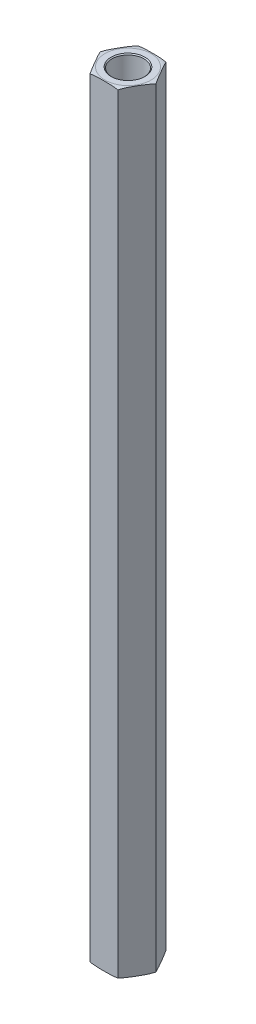
ISO-10303-21;
HEADER;
FILE_DESCRIPTION(('STEP AP214'),'2;1');
FILE_NAME('part.step','',(''),(''),'','','');
FILE_SCHEMA(('AUTOMOTIVE_DESIGN { 1 0 10303 214 1 1 1 1 }'));
ENDSEC;
DATA;
#1=APPLICATION_CONTEXT('core data for automotive mechanical design processes');
#2=APPLICATION_PROTOCOL_DEFINITION('international standard','automotive_design',2000,#1);
#3=PRODUCT_CONTEXT('',#1,'mechanical');
#4=PRODUCT('Part','Part','',(#3));
#5=PRODUCT_RELATED_PRODUCT_CATEGORY('part','',(#4));
#6=PRODUCT_DEFINITION_FORMATION('','',#4);
#7=PRODUCT_DEFINITION_CONTEXT('part definition',#1,'design');
#8=PRODUCT_DEFINITION('design','',#6,#7);
#9=PRODUCT_DEFINITION_SHAPE('','',#8);
#10=(LENGTH_UNIT() NAMED_UNIT(*) SI_UNIT(.MILLI.,.METRE.));
#11=(NAMED_UNIT(*) PLANE_ANGLE_UNIT() SI_UNIT($,.RADIAN.));
#12=(NAMED_UNIT(*) SI_UNIT($,.STERADIAN.) SOLID_ANGLE_UNIT());
#13=UNCERTAINTY_MEASURE_WITH_UNIT(LENGTH_MEASURE(1.E-05),#10,'distance_accuracy_value','');
#14=(GEOMETRIC_REPRESENTATION_CONTEXT(3) GLOBAL_UNCERTAINTY_ASSIGNED_CONTEXT((#13)) GLOBAL_UNIT_ASSIGNED_CONTEXT((#10,
#11,#12)) REPRESENTATION_CONTEXT('',''));
#15=CARTESIAN_POINT('',(0.,0.,0.));
#16=DIRECTION('',(0.,0.,1.));
#17=DIRECTION('',(1.,0.,0.));
#18=AXIS2_PLACEMENT_3D('',#15,#16,#17);
#19=CARTESIAN_POINT('',(0.,38.1,0.));
#20=DIRECTION('',(0.,1.,0.));
#21=DIRECTION('',(0.,0.,1.));
#22=AXIS2_PLACEMENT_3D('',#19,#20,#21);
#23=PLANE('',#22);
#24=CARTESIAN_POINT('',(0.,38.1,0.));
#25=DIRECTION('',(0.,1.,0.));
#26=DIRECTION('',(0.,0.,1.));
#27=AXIS2_PLACEMENT_3D('',#24,#25,#26);
#28=CIRCLE('',#27,2.0955);
#29=CARTESIAN_POINT('',(0.,38.1,2.0955));
#30=VERTEX_POINT('',#29);
#31=EDGE_CURVE('E400',#30,#30,#28,.T.);
#32=ORIENTED_EDGE('',*,*,#31,.T.);
#33=EDGE_LOOP('',(#32));
#34=FACE_BOUND('',#33,.T.);
#35=ADVANCED_FACE('F16',(#34),#23,.T.);
#36=CARTESIAN_POINT('',(0.,-38.1,0.));
#37=DIRECTION('',(0.,-1.,0.));
#38=DIRECTION('',(0.,0.,-1.));
#39=AXIS2_PLACEMENT_3D('',#36,#37,#38);
#40=PLANE('',#39);
#41=CARTESIAN_POINT('',(0.,-38.1,0.));
#42=DIRECTION('',(0.,-1.,0.));
#43=DIRECTION('',(0.,0.,-1.));
#44=AXIS2_PLACEMENT_3D('',#41,#42,#43);
#45=CIRCLE('',#44,2.0955);
#46=CARTESIAN_POINT('',(0.,-38.1,-2.0955));
#47=VERTEX_POINT('',#46);
#48=EDGE_CURVE('E129',#47,#47,#45,.T.);
#49=ORIENTED_EDGE('',*,*,#48,.T.);
#50=EDGE_LOOP('',(#49));
#51=FACE_BOUND('',#50,.T.);
#52=ADVANCED_FACE('F383',(#51),#40,.T.);
#53=CARTESIAN_POINT('',(0.,38.1,0.));
#54=DIRECTION('',(0.,1.,0.));
#55=DIRECTION('',(0.,0.,1.));
#56=AXIS2_PLACEMENT_3D('',#53,#54,#55);
#57=CYLINDRICAL_SURFACE('',#56,2.0955);
#58=CARTESIAN_POINT('',(0.,50.6729999999607,0.));
#59=DIRECTION('',(0.,1.,0.));
#60=DIRECTION('',(0.,0.,1.));
#61=AXIS2_PLACEMENT_3D('',#58,#59,#60);
#62=CIRCLE('',#61,2.09549999999581);
#63=CARTESIAN_POINT('',(0.,50.6729999999607,2.09549999999581));
#64=VERTEX_POINT('',#63);
#65=EDGE_CURVE('E127',#64,#64,#62,.T.);
#66=ORIENTED_EDGE('',*,*,#65,.T.);
#67=EDGE_LOOP('',(#66));
#68=FACE_BOUND('',#67,.T.);
#69=ORIENTED_EDGE('',*,*,#31,.F.);
#70=EDGE_LOOP('',(#69));
#71=FACE_BOUND('',#70,.T.);
#72=ADVANCED_FACE('F375',(#68,#71),#57,.F.);
#73=CARTESIAN_POINT('',(0.,-38.1,0.));
#74=DIRECTION('',(0.,-1.,0.));
#75=DIRECTION('',(0.,0.,-1.));
#76=AXIS2_PLACEMENT_3D('',#73,#74,#75);
#77=CYLINDRICAL_SURFACE('',#76,2.0955);
#78=ORIENTED_EDGE('',*,*,#48,.F.);
#79=EDGE_LOOP('',(#78));
#80=FACE_BOUND('',#79,.T.);
#81=CARTESIAN_POINT('',(0.,-50.6729999999607,0.));
#82=DIRECTION('',(0.,-1.,0.));
#83=DIRECTION('',(0.,0.,-1.));
#84=AXIS2_PLACEMENT_3D('',#81,#82,#83);
#85=CIRCLE('',#84,2.09550000005265);
#86=CARTESIAN_POINT('',(0.,-50.6729999999607,-2.09550000005265));
#87=VERTEX_POINT('',#86);
#88=EDGE_CURVE('E92',#87,#87,#85,.T.);
#89=ORIENTED_EDGE('',*,*,#88,.T.);
#90=EDGE_LOOP('',(#89));
#91=FACE_BOUND('',#90,.T.);
#92=ADVANCED_FACE('F367',(#80,#91),#77,.F.);
#93=CARTESIAN_POINT('',(0.,50.7999999999811,0.));
#94=DIRECTION('',(0.,1.,0.));
#95=DIRECTION('',(0.,0.,1.));
#96=AXIS2_PLACEMENT_3D('',#93,#94,#95);
#97=CONICAL_SURFACE('',#96,2.22249999995938,0.785398163173655);
#98=CARTESIAN_POINT('',(0.,50.7999999999811,0.));
#99=DIRECTION('',(0.,1.,0.));
#100=DIRECTION('',(0.,0.,1.));
#101=AXIS2_PLACEMENT_3D('',#98,#99,#100);
#102=CIRCLE('',#101,2.22249999995938);
#103=CARTESIAN_POINT('',(0.,50.7999999999811,2.22249999995938));
#104=VERTEX_POINT('',#103);
#105=EDGE_CURVE('E204',#104,#104,#102,.T.);
#106=ORIENTED_EDGE('',*,*,#105,.T.);
#107=EDGE_LOOP('',(#106));
#108=FACE_BOUND('',#107,.T.);
#109=ORIENTED_EDGE('',*,*,#65,.F.);
#110=EDGE_LOOP('',(#109));
#111=FACE_BOUND('',#110,.T.);
#112=ADVANCED_FACE('F360',(#108,#111),#97,.F.);
#113=CARTESIAN_POINT('',(0.,-50.7999999999242,0.));
#114=DIRECTION('',(0.,-1.,0.));
#115=DIRECTION('',(1.,0.,0.));
#116=AXIS2_PLACEMENT_3D('',#113,#114,#115);
#117=CONICAL_SURFACE('',#116,2.22249999995938,0.785398163397448);
#118=ORIENTED_EDGE('',*,*,#88,.F.);
#119=EDGE_LOOP('',(#118));
#120=FACE_BOUND('',#119,.T.);
#121=CARTESIAN_POINT('',(0.,-50.7999999999811,0.));
#122=DIRECTION('',(0.,-1.,0.));
#123=DIRECTION('',(1.,0.,0.));
#124=AXIS2_PLACEMENT_3D('',#121,#122,#123);
#125=CIRCLE('',#124,2.22250000001623);
#126=CARTESIAN_POINT('',(2.22250000001623,-50.7999999999811,0.));
#127=VERTEX_POINT('',#126);
#128=EDGE_CURVE('E199',#127,#127,#125,.F.);
#129=ORIENTED_EDGE('',*,*,#128,.F.);
#130=EDGE_LOOP('',(#129));
#131=FACE_BOUND('',#130,.T.);
#132=ADVANCED_FACE('F354',(#120,#131),#117,.F.);
#133=CARTESIAN_POINT('',(1.83308710467706,50.8,3.17499999999999));
#134=DIRECTION('',(-0.866025403784439,0.,-0.5));
#135=DIRECTION('',(-0.5,0.,0.866025403784439));
#136=AXIS2_PLACEMENT_3D('',#133,#134,#135);
#137=PLANE('',#136);
#138=DIRECTION('',(0.,1.,0.));
#139=VECTOR('',#138,1.);
#140=CARTESIAN_POINT('',(3.66617420935412,50.8,0.));
#141=LINE('',#140,#139);
#142=CARTESIAN_POINT('',(3.66617420935412,-50.673,0.));
#143=VERTEX_POINT('',#142);
#144=CARTESIAN_POINT('',(3.66617420935412,50.673,0.));
#145=VERTEX_POINT('',#144);
#146=EDGE_CURVE('E74',#143,#145,#141,.T.);
#147=ORIENTED_EDGE('',*,*,#146,.T.);
#148=CARTESIAN_POINT('',(1.83308710467706,50.673,3.175));
#149=CARTESIAN_POINT('',(1.87128169935724,50.6889014148997,3.10884502143944));
#150=CARTESIAN_POINT('',(1.90969320538961,50.7024886076105,3.04231434139612));
#151=CARTESIAN_POINT('',(1.98677079607407,50.7258161979402,2.90881203820563));
#152=CARTESIAN_POINT('',(2.02543658353272,50.7355604771397,2.8418409298126));
#153=CARTESIAN_POINT('',(2.10284499535245,50.7519966530451,2.70776562760761));
#154=CARTESIAN_POINT('',(2.14158731769806,50.7586945328669,2.64066195690181));
#155=CARTESIAN_POINT('',(2.21916296783005,50.7697767572932,2.50629698944301));
#156=CARTESIAN_POINT('',(2.25799631815347,50.774160450474,2.43903565365472));
#157=CARTESIAN_POINT('',(2.33572065438804,50.7812403004263,2.30441315431189));
#158=CARTESIAN_POINT('',(2.37461166028642,50.7839355237591,2.23705195613842));
#159=CARTESIAN_POINT('',(2.45240986808526,50.7881531983713,2.10230150749304));
#160=CARTESIAN_POINT('',(2.49131707051149,50.7896756080272,2.03491225611044));
#161=CARTESIAN_POINT('',(2.56874613804245,50.791922705889,1.90080117716413));
#162=CARTESIAN_POINT('',(2.60726795154184,50.7926552468181,1.8340794389835));
#163=CARTESIAN_POINT('',(2.68431353056975,50.7935767302574,1.7006325816086));
#164=CARTESIAN_POINT('',(2.72283729611679,50.7937656658949,1.63390746238225));
#165=CARTESIAN_POINT('',(2.79990166972106,50.7936659966806,1.50042805184618));
#166=CARTESIAN_POINT('',(2.83844227771297,50.7933771811766,1.4336737606496));
#167=CARTESIAN_POINT('',(2.91552223317789,50.792221986219,1.30016736153922));
#168=CARTESIAN_POINT('',(2.95406158061873,50.7913555970386,1.23341525368112));
#169=CARTESIAN_POINT('',(3.03113161773348,50.7887861940656,1.09992603365716));
#170=CARTESIAN_POINT('',(3.06966230777154,50.7870832271616,1.03318892086056));
#171=CARTESIAN_POINT('',(3.1467048006221,50.7824387229726,0.899747408901619));
#172=CARTESIAN_POINT('',(3.18521660427676,50.7794972471358,0.833043008280634));
#173=CARTESIAN_POINT('',(3.24841925163174,50.7732174124749,0.723572811888951));
#174=CARTESIAN_POINT('',(3.27312282066109,50.7703980110463,0.680784975201837));
#175=CARTESIAN_POINT('',(3.32249186130891,50.7638696794304,0.595275288478879));
#176=CARTESIAN_POINT('',(3.34715734368935,50.7601610809139,0.552553419802756));
#177=CARTESIAN_POINT('',(3.39643377591422,50.7516802711497,0.467204135573549));
#178=CARTESIAN_POINT('',(3.42104474295589,50.7469084657008,0.424576690233975));
#179=CARTESIAN_POINT('',(3.47026036719569,50.7360987712516,0.339332728524436));
#180=CARTESIAN_POINT('',(3.49486485317655,50.7300577313084,0.296716508711466));
#181=CARTESIAN_POINT('',(3.54398805502185,50.7165138354161,0.211632627284947));
#182=CARTESIAN_POINT('',(3.56850671785504,50.709010197803,0.169165057524208));
#183=CARTESIAN_POINT('',(3.61743974029947,50.6923203507084,0.0844105764825507));
#184=CARTESIAN_POINT('',(3.64185387349848,50.6831314978033,0.0421240573591031));
#185=CARTESIAN_POINT('',(3.66617420935412,50.673,0.));
#186=B_SPLINE_CURVE_WITH_KNOTS('',3,(#148,#149,#150,#151,#152,#153,#154,#155,#156,#157,#158,
#159,#160,#161,#162,#163,#164,#165,#166,#167,#168,#169,#170,#171,#172,#173,#174,#175,#176,#177,
#178,#179,#180,#181,#182,#183,#184,#185),.UNSPECIFIED.,.F.,.F.,(4,2,2,2,2,2,2,2,2,2,2,2,2,2,2,2,
2,2,4),(0.,0.233977307817941,0.467717675040694,0.7009969735575,0.934341903229751,
1.1678157196724,1.40129782179825,1.6324366580967,1.86357841666617,2.09482211846294,
2.32606971471495,2.55730435147398,2.78852751694413,2.93698369265087,3.08538458004473,
3.23372892334584,3.38244598546612,3.53124274626083,3.68027493713584),.UNSPECIFIED.);
#187=CARTESIAN_POINT('',(1.83308710467706,50.673,3.17499999999999));
#188=VERTEX_POINT('',#187);
#189=EDGE_CURVE('E98',#188,#145,#186,.T.);
#190=ORIENTED_EDGE('',*,*,#189,.F.);
#191=DIRECTION('',(0.,1.,0.));
#192=VECTOR('',#191,1.);
#193=CARTESIAN_POINT('',(1.83308710467706,50.8,3.17499999999999));
#194=LINE('',#193,#192);
#195=CARTESIAN_POINT('',(1.83308710467706,-50.673,3.17499999999999));
#196=VERTEX_POINT('',#195);
#197=EDGE_CURVE('E91',#188,#196,#194,.F.);
#198=ORIENTED_EDGE('',*,*,#197,.T.);
#199=CARTESIAN_POINT('',(3.66617420935412,-50.673,0.));
#200=CARTESIAN_POINT('',(3.62797961467395,-50.6889014148997,0.066154978560558));
#201=CARTESIAN_POINT('',(3.58956810864157,-50.7024886076105,0.132685658603875));
#202=CARTESIAN_POINT('',(3.51249051795711,-50.7258161979402,0.266187961794359));
#203=CARTESIAN_POINT('',(3.47382473049846,-50.7355604771397,0.33315907018739));
#204=CARTESIAN_POINT('',(3.39641631867873,-50.7519966530451,0.467234372392382));
#205=CARTESIAN_POINT('',(3.35767399633312,-50.7586945328669,0.534338043098185));
#206=CARTESIAN_POINT('',(3.28009834620113,-50.7697767572932,0.668703010556983));
#207=CARTESIAN_POINT('',(3.24126499587771,-50.774160450474,0.735964346345271));
#208=CARTESIAN_POINT('',(3.16354065964315,-50.7812403004263,0.870586845688102));
#209=CARTESIAN_POINT('',(3.12464965374476,-50.7839355237591,0.937948043861573));
#210=CARTESIAN_POINT('',(3.04685144594593,-50.7881531983713,1.07269849250695));
#211=CARTESIAN_POINT('',(3.00794424351969,-50.7896756080272,1.14008774388956));
#212=CARTESIAN_POINT('',(2.93051517598873,-50.791922705889,1.27419882283586));
#213=CARTESIAN_POINT('',(2.89199336248934,-50.7926552468181,1.34092056101649));
#214=CARTESIAN_POINT('',(2.81494778346143,-50.7935767302574,1.4743674183914));
#215=CARTESIAN_POINT('',(2.77642401791439,-50.7937656658949,1.54109253761775));
#216=CARTESIAN_POINT('',(2.69935964431012,-50.7936659966806,1.67457194815381));
#217=CARTESIAN_POINT('',(2.66081903631821,-50.7933771811766,1.7413262393504));
#218=CARTESIAN_POINT('',(2.58373908085329,-50.792221986219,1.87483263846078));
#219=CARTESIAN_POINT('',(2.54519973341245,-50.7913555970386,1.94158474631887));
#220=CARTESIAN_POINT('',(2.4681296962977,-50.7887861940656,2.07507396634283));
#221=CARTESIAN_POINT('',(2.42959900625965,-50.7870832271616,2.14181107913943));
#222=CARTESIAN_POINT('',(2.35255651340908,-50.7824387229726,2.27525259109837));
#223=CARTESIAN_POINT('',(2.31404470975442,-50.7794972471358,2.34195699171936));
#224=CARTESIAN_POINT('',(2.25084206239944,-50.7732174124749,2.45142718811104));
#225=CARTESIAN_POINT('',(2.2261384933701,-50.7703980110463,2.49421502479816));
#226=CARTESIAN_POINT('',(2.17676945272228,-50.7638696794304,2.57972471152112));
#227=CARTESIAN_POINT('',(2.15210397034183,-50.7601610809139,2.62244658019724));
#228=CARTESIAN_POINT('',(2.10282753811696,-50.7516802711497,2.70779586442645));
#229=CARTESIAN_POINT('',(2.07821657107529,-50.7469084657008,2.75042330976602));
#230=CARTESIAN_POINT('',(2.02900094683549,-50.7360987712516,2.83566727147556));
#231=CARTESIAN_POINT('',(2.00439646085463,-50.7300577313084,2.87828349128853));
#232=CARTESIAN_POINT('',(1.95527325900933,-50.7165138354161,2.96336737271505));
#233=CARTESIAN_POINT('',(1.93075459617614,-50.709010197803,3.00583494247579));
#234=CARTESIAN_POINT('',(1.88182157373171,-50.6923203507084,3.09058942351745));
#235=CARTESIAN_POINT('',(1.8574074405327,-50.6831314978033,3.13287594264089));
#236=CARTESIAN_POINT('',(1.83308710467706,-50.673,3.175));
#237=B_SPLINE_CURVE_WITH_KNOTS('',3,(#199,#200,#201,#202,#203,#204,#205,#206,#207,#208,#209,
#210,#211,#212,#213,#214,#215,#216,#217,#218,#219,#220,#221,#222,#223,#224,#225,#226,#227,#228,
#229,#230,#231,#232,#233,#234,#235,#236),.UNSPECIFIED.,.F.,.F.,(4,2,2,2,2,2,2,2,2,2,2,2,2,2,2,2,
2,2,4),(0.,0.233977307817942,0.467717675040694,0.7009969735575,0.934341903229751,
1.1678157196724,1.40129782179825,1.6324366580967,1.86357841666617,2.09482211846294,
2.32606971471495,2.55730435147398,2.78852751694413,2.93698369265087,3.08538458004473,
3.23372892334584,3.38244598546612,3.53124274626084,3.68027493713585),.UNSPECIFIED.);
#238=EDGE_CURVE('E85',#143,#196,#237,.T.);
#239=ORIENTED_EDGE('',*,*,#238,.F.);
#240=EDGE_LOOP('',(#147,#190,#198,#239));
#241=FACE_BOUND('',#240,.T.);
#242=ADVANCED_FACE('F89',(#241),#137,.F.);
#243=CARTESIAN_POINT('',(3.66617420935412,50.8,0.));
#244=DIRECTION('',(-0.866025403784439,0.,0.5));
#245=DIRECTION('',(0.5,0.,0.866025403784439));
#246=AXIS2_PLACEMENT_3D('',#243,#244,#245);
#247=PLANE('',#246);
#248=DIRECTION('',(0.,1.,0.));
#249=VECTOR('',#248,1.);
#250=CARTESIAN_POINT('',(1.83308710467706,50.8,-3.175));
#251=LINE('',#250,#249);
#252=CARTESIAN_POINT('',(1.83308710467706,-50.673,-3.175));
#253=VERTEX_POINT('',#252);
#254=CARTESIAN_POINT('',(1.83308710467706,50.673,-3.175));
#255=VERTEX_POINT('',#254);
#256=EDGE_CURVE('E163',#253,#255,#251,.T.);
#257=ORIENTED_EDGE('',*,*,#256,.T.);
#258=CARTESIAN_POINT('',(3.66617420935412,50.673,0.));
#259=CARTESIAN_POINT('',(3.62797961467395,50.6889014148997,-0.0661549785605553));
#260=CARTESIAN_POINT('',(3.58956810864157,50.7024886076105,-0.132685658603872));
#261=CARTESIAN_POINT('',(3.51249051795711,50.7258161979402,-0.266187961794356));
#262=CARTESIAN_POINT('',(3.47382473049846,50.7355604771397,-0.333159070187387));
#263=CARTESIAN_POINT('',(3.39641631867873,50.7519966530451,-0.467234372392379));
#264=CARTESIAN_POINT('',(3.35767399633312,50.7586945328669,-0.534338043098182));
#265=CARTESIAN_POINT('',(3.28009834620113,50.7697767572932,-0.66870301055698));
#266=CARTESIAN_POINT('',(3.24126499587771,50.774160450474,-0.735964346345267));
#267=CARTESIAN_POINT('',(3.16354065964315,50.7812403004263,-0.870586845688098));
#268=CARTESIAN_POINT('',(3.12464965374476,50.7839355237591,-0.937948043861569));
#269=CARTESIAN_POINT('',(3.04685144594593,50.7881531983713,-1.07269849250695));
#270=CARTESIAN_POINT('',(3.00794424351969,50.7896756080272,-1.14008774388955));
#271=CARTESIAN_POINT('',(2.93051517598873,50.791922705889,-1.27419882283586));
#272=CARTESIAN_POINT('',(2.89199336248934,50.7926552468181,-1.34092056101649));
#273=CARTESIAN_POINT('',(2.81494778346143,50.7935767302574,-1.47436741839139));
#274=CARTESIAN_POINT('',(2.77642401791439,50.7937656658949,-1.54109253761774));
#275=CARTESIAN_POINT('',(2.69935964431012,50.7936659966806,-1.67457194815381));
#276=CARTESIAN_POINT('',(2.66081903631821,50.7933771811766,-1.74132623935039));
#277=CARTESIAN_POINT('',(2.58373908085329,50.792221986219,-1.87483263846077));
#278=CARTESIAN_POINT('',(2.54519973341245,50.7913555970386,-1.94158474631887));
#279=CARTESIAN_POINT('',(2.4681296962977,50.7887861940656,-2.07507396634283));
#280=CARTESIAN_POINT('',(2.42959900625965,50.7870832271616,-2.14181107913943));
#281=CARTESIAN_POINT('',(2.35255651340908,50.7824387229726,-2.27525259109837));
#282=CARTESIAN_POINT('',(2.31404470975442,50.7794972471358,-2.34195699171935));
#283=CARTESIAN_POINT('',(2.25084206239944,50.7732174124749,-2.45142718811104));
#284=CARTESIAN_POINT('',(2.2261384933701,50.7703980110463,-2.49421502479815));
#285=CARTESIAN_POINT('',(2.17676945272227,50.7638696794304,-2.57972471152111));
#286=CARTESIAN_POINT('',(2.15210397034183,50.7601610809139,-2.62244658019724));
#287=CARTESIAN_POINT('',(2.10282753811695,50.7516802711497,-2.70779586442645));
#288=CARTESIAN_POINT('',(2.07821657107529,50.7469084657008,-2.75042330976602));
#289=CARTESIAN_POINT('',(2.02900094683549,50.7360987712516,-2.83566727147556));
#290=CARTESIAN_POINT('',(2.00439646085463,50.7300577313084,-2.87828349128853));
#291=CARTESIAN_POINT('',(1.95527325900933,50.7165138354161,-2.96336737271505));
#292=CARTESIAN_POINT('',(1.93075459617614,50.709010197803,-3.00583494247579));
#293=CARTESIAN_POINT('',(1.88182157373171,50.6923203507084,-3.09058942351745));
#294=CARTESIAN_POINT('',(1.85740744053269,50.6831314978033,-3.1328759426409));
#295=CARTESIAN_POINT('',(1.83308710467705,50.673,-3.175));
#296=B_SPLINE_CURVE_WITH_KNOTS('',3,(#258,#259,#260,#261,#262,#263,#264,#265,#266,#267,#268,
#269,#270,#271,#272,#273,#274,#275,#276,#277,#278,#279,#280,#281,#282,#283,#284,#285,#286,#287,
#288,#289,#290,#291,#292,#293,#294,#295),.UNSPECIFIED.,.F.,.F.,(4,2,2,2,2,2,2,2,2,2,2,2,2,2,2,2,
2,2,4),(0.,0.233977307817942,0.467717675040694,0.7009969735575,0.93434190322975,1.1678157196724,
1.40129782179824,1.63243665809669,1.86357841666617,2.09482211846294,2.32606971471494,
2.55730435147397,2.78852751694413,2.93698369265087,3.08538458004474,3.23372892334585,
3.38244598546613,3.53124274626085,3.68027493713586),.UNSPECIFIED.);
#297=EDGE_CURVE('E82',#145,#255,#296,.T.);
#298=ORIENTED_EDGE('',*,*,#297,.F.);
#299=ORIENTED_EDGE('',*,*,#146,.F.);
#300=CARTESIAN_POINT('',(1.83308710467706,-50.673,-3.175));
#301=CARTESIAN_POINT('',(1.87128169935723,-50.6889014148997,-3.10884502143944));
#302=CARTESIAN_POINT('',(1.90969320538961,-50.7024886076105,-3.04231434139612));
#303=CARTESIAN_POINT('',(1.98677079607407,-50.7258161979402,-2.90881203820564));
#304=CARTESIAN_POINT('',(2.02543658353271,-50.7355604771397,-2.84184092981261));
#305=CARTESIAN_POINT('',(2.10284499535244,-50.7519966530451,-2.70776562760762));
#306=CARTESIAN_POINT('',(2.14158731769805,-50.7586945328669,-2.64066195690181));
#307=CARTESIAN_POINT('',(2.21916296783004,-50.7697767572932,-2.50629698944302));
#308=CARTESIAN_POINT('',(2.25799631815347,-50.774160450474,-2.43903565365473));
#309=CARTESIAN_POINT('',(2.33572065438803,-50.7812403004263,-2.3044131543119));
#310=CARTESIAN_POINT('',(2.37461166028642,-50.7839355237591,-2.23705195613843));
#311=CARTESIAN_POINT('',(2.45240986808525,-50.7881531983713,-2.10230150749305));
#312=CARTESIAN_POINT('',(2.49131707051148,-50.7896756080272,-2.03491225611045));
#313=CARTESIAN_POINT('',(2.56874613804245,-50.791922705889,-1.90080117716414));
#314=CARTESIAN_POINT('',(2.60726795154183,-50.7926552468181,-1.83407943898351));
#315=CARTESIAN_POINT('',(2.68431353056974,-50.7935767302574,-1.70063258160861));
#316=CARTESIAN_POINT('',(2.72283729611679,-50.7937656658949,-1.63390746238225));
#317=CARTESIAN_POINT('',(2.79990166972105,-50.7936659966806,-1.50042805184619));
#318=CARTESIAN_POINT('',(2.83844227771296,-50.7933771811766,-1.43367376064961));
#319=CARTESIAN_POINT('',(2.91552223317788,-50.792221986219,-1.30016736153923));
#320=CARTESIAN_POINT('',(2.95406158061872,-50.7913555970386,-1.23341525368113));
#321=CARTESIAN_POINT('',(3.03113161773347,-50.7887861940656,-1.09992603365718));
#322=CARTESIAN_POINT('',(3.06966230777153,-50.7870832271616,-1.03318892086057));
#323=CARTESIAN_POINT('',(3.14670480062209,-50.7824387229726,-0.899747408901631));
#324=CARTESIAN_POINT('',(3.18521660427675,-50.7794972471358,-0.833043008280646));
#325=CARTESIAN_POINT('',(3.24841925163173,-50.7732174124749,-0.723572811888963));
#326=CARTESIAN_POINT('',(3.27312282066108,-50.7703980110463,-0.680784975201848));
#327=CARTESIAN_POINT('',(3.3224918613089,-50.7638696794304,-0.595275288478888));
#328=CARTESIAN_POINT('',(3.34715734368934,-50.7601610809139,-0.552553419802764));
#329=CARTESIAN_POINT('',(3.39643377591422,-50.7516802711497,-0.467204135573556));
#330=CARTESIAN_POINT('',(3.42104474295589,-50.7469084657008,-0.424576690233981));
#331=CARTESIAN_POINT('',(3.47026036719568,-50.7360987712516,-0.33933272852444));
#332=CARTESIAN_POINT('',(3.49486485317654,-50.7300577313084,-0.296716508711469));
#333=CARTESIAN_POINT('',(3.54398805502184,-50.7165138354161,-0.211632627284948));
#334=CARTESIAN_POINT('',(3.56850671785504,-50.709010197803,-0.169165057524208));
#335=CARTESIAN_POINT('',(3.61743974029947,-50.6923203507084,-0.0844105764825488));
#336=CARTESIAN_POINT('',(3.64185387349848,-50.6831314978033,-0.0421240573591002));
#337=CARTESIAN_POINT('',(3.66617420935412,-50.673,0.));
#338=B_SPLINE_CURVE_WITH_KNOTS('',3,(#300,#301,#302,#303,#304,#305,#306,#307,#308,#309,#310,
#311,#312,#313,#314,#315,#316,#317,#318,#319,#320,#321,#322,#323,#324,#325,#326,#327,#328,#329,
#330,#331,#332,#333,#334,#335,#336,#337),.UNSPECIFIED.,.F.,.F.,(4,2,2,2,2,2,2,2,2,2,2,2,2,2,2,2,
2,2,4),(0.,0.233977307817941,0.467717675040692,0.700996973557498,0.934341903229747,
1.16781571967239,1.40129782179824,1.63243665809669,1.86357841666616,2.09482211846293,
2.32606971471494,2.55730435147397,2.78852751694412,2.93698369265086,3.08538458004473,
3.23372892334584,3.38244598546612,3.53124274626084,3.68027493713585),.UNSPECIFIED.);
#339=EDGE_CURVE('E79',#253,#143,#338,.T.);
#340=ORIENTED_EDGE('',*,*,#339,.F.);
#341=EDGE_LOOP('',(#257,#298,#299,#340));
#342=FACE_BOUND('',#341,.T.);
#343=ADVANCED_FACE('F77',(#342),#247,.F.);
#344=CARTESIAN_POINT('',(-1.83308710467707,50.8,-3.175));
#345=DIRECTION('',(0.,-1.,0.));
#346=DIRECTION('',(0.,0.,-1.));
#347=AXIS2_PLACEMENT_3D('',#344,#345,#346);
#348=PLANE('',#347);
#349=CARTESIAN_POINT('',(0.,50.8,0.));
#350=DIRECTION('',(0.,-1.,0.));
#351=DIRECTION('',(0.,0.,1.));
#352=AXIS2_PLACEMENT_3D('',#349,#350,#351);
#353=CIRCLE('',#352,3.03117420935412);
#354=CARTESIAN_POINT('',(0.,50.8,3.03117420935412));
#355=VERTEX_POINT('',#354);
#356=CARTESIAN_POINT('',(0.,50.8,-3.03117420935412));
#357=VERTEX_POINT('',#356);
#358=EDGE_CURVE('E240',#355,#357,#353,.T.);
#359=ORIENTED_EDGE('',*,*,#358,.F.);
#360=CARTESIAN_POINT('',(0.,50.8,0.));
#361=DIRECTION('',(0.,-1.,0.));
#362=DIRECTION('',(0.,0.,-1.));
#363=AXIS2_PLACEMENT_3D('',#360,#361,#362);
#364=CIRCLE('',#363,3.03117420935412);
#365=EDGE_CURVE('E203',#357,#355,#364,.T.);
#366=ORIENTED_EDGE('',*,*,#365,.F.);
#367=EDGE_LOOP('',(#359,#366));
#368=FACE_BOUND('',#367,.T.);
#369=ORIENTED_EDGE('',*,*,#105,.F.);
#370=EDGE_LOOP('',(#369));
#371=FACE_BOUND('',#370,.T.);
#372=ADVANCED_FACE('F211',(#368,#371),#348,.F.);
#373=CARTESIAN_POINT('',(-1.83308710467707,-50.8,-3.175));
#374=DIRECTION('',(0.,-1.,0.));
#375=DIRECTION('',(0.,0.,-1.));
#376=AXIS2_PLACEMENT_3D('',#373,#374,#375);
#377=PLANE('',#376);
#378=CARTESIAN_POINT('',(0.,-50.8,0.));
#379=DIRECTION('',(0.,1.,0.));
#380=DIRECTION('',(0.,0.,1.));
#381=AXIS2_PLACEMENT_3D('',#378,#379,#380);
#382=CIRCLE('',#381,3.03117420935412);
#383=CARTESIAN_POINT('',(0.,-50.8,-3.03117420935412));
#384=VERTEX_POINT('',#383);
#385=CARTESIAN_POINT('',(0.,-50.8,3.03117420935412));
#386=VERTEX_POINT('',#385);
#387=EDGE_CURVE('E202',#384,#386,#382,.F.);
#388=ORIENTED_EDGE('',*,*,#387,.T.);
#389=CARTESIAN_POINT('',(0.,-50.8,0.));
#390=DIRECTION('',(0.,1.,0.));
#391=DIRECTION('',(0.,0.,-1.));
#392=AXIS2_PLACEMENT_3D('',#389,#390,#391);
#393=CIRCLE('',#392,3.03117420935412);
#394=EDGE_CURVE('E267',#384,#386,#393,.T.);
#395=ORIENTED_EDGE('',*,*,#394,.F.);
#396=EDGE_LOOP('',(#388,#395));
#397=FACE_BOUND('',#396,.T.);
#398=ORIENTED_EDGE('',*,*,#128,.T.);
#399=EDGE_LOOP('',(#398));
#400=FACE_BOUND('',#399,.T.);
#401=ADVANCED_FACE('F217',(#397,#400),#377,.T.);
#402=CARTESIAN_POINT('',(-1.83308710467707,50.8,3.175));
#403=DIRECTION('',(0.,0.,-1.));
#404=DIRECTION('',(-1.,0.,0.));
#405=AXIS2_PLACEMENT_3D('',#402,#403,#404);
#406=PLANE('',#405);
#407=ORIENTED_EDGE('',*,*,#197,.F.);
#408=CARTESIAN_POINT('',(-1.83308710467706,50.673,3.175));
#409=CARTESIAN_POINT('',(-1.73237579828684,50.6939400141518,3.175));
#410=CARTESIAN_POINT('',(-1.63096506893486,50.7108853495327,3.175));
#411=CARTESIAN_POINT('',(-1.42767146651469,50.7384971643984,3.175));
#412=CARTESIAN_POINT('',(-1.32579191427254,50.7491875658753,3.175));
#413=CARTESIAN_POINT('',(-1.12177634709138,50.7661280408079,3.175));
#414=CARTESIAN_POINT('',(-1.0196405664338,50.7723812707189,3.175));
#415=CARTESIAN_POINT('',(-0.815663681397378,50.7819028064183,3.175));
#416=CARTESIAN_POINT('',(-0.713823115514575,50.7851834044999,3.175));
#417=CARTESIAN_POINT('',(-0.510018485441652,50.7899454848703,3.175));
#418=CARTESIAN_POINT('',(-0.408054390577978,50.7914254100882,3.175));
#419=CARTESIAN_POINT('',(-0.204060200337871,50.7933146818379,3.175));
#420=CARTESIAN_POINT('',(-0.102030100168935,50.7937234241492,3.175));
#421=CARTESIAN_POINT('',(0.102030100168936,50.7937234241492,3.175));
#422=CARTESIAN_POINT('',(0.204060200337871,50.7933146818379,3.175));
#423=CARTESIAN_POINT('',(0.408054390577978,50.7914254100882,3.17499999999999));
#424=CARTESIAN_POINT('',(0.510018485441653,50.7899454848703,3.17499999999999));
#425=CARTESIAN_POINT('',(0.713823115514576,50.7851834044999,3.17499999999999));
#426=CARTESIAN_POINT('',(0.815663681397379,50.7819028064183,3.17499999999999));
#427=CARTESIAN_POINT('',(1.0196405664338,50.7723812707189,3.17499999999999));
#428=CARTESIAN_POINT('',(1.12177634709138,50.7661280408079,3.17499999999999));
#429=CARTESIAN_POINT('',(1.32579191427254,50.7491875658753,3.17499999999999));
#430=CARTESIAN_POINT('',(1.4276714665147,50.7384971643984,3.17499999999999));
#431=CARTESIAN_POINT('',(1.63096506893487,50.7108853495327,3.17499999999999));
#432=CARTESIAN_POINT('',(1.73237579828684,50.6939400141518,3.17499999999999));
#433=CARTESIAN_POINT('',(1.83308710467707,50.673,3.17499999999999));
#434=B_SPLINE_CURVE_WITH_KNOTS('',3,(#408,#409,#410,#411,#412,#413,#414,#415,#416,#417,#418,
#419,#420,#421,#422,#423,#424,#425,#426,#427,#428,#429,#430,#431,#432,#433),.UNSPECIFIED.,.F.,
.F.,(4,2,2,2,2,2,2,2,2,2,2,2,4),(0.,0.308333242342809,0.615479423308237,0.922406891130011,
1.2280592962085,1.53397581645216,1.84006485747889,2.14615389850562,2.45207041874928,
2.75772282382777,3.06465029164955,3.37179647261498,3.68012971495779),.UNSPECIFIED.);
#435=CARTESIAN_POINT('',(-1.83308710467706,50.673,3.175));
#436=VERTEX_POINT('',#435);
#437=EDGE_CURVE('E189',#436,#188,#434,.T.);
#438=ORIENTED_EDGE('',*,*,#437,.F.);
#439=DIRECTION('',(0.,1.,0.));
#440=VECTOR('',#439,1.);
#441=CARTESIAN_POINT('',(-1.83308710467707,50.8,3.175));
#442=LINE('',#441,#440);
#443=CARTESIAN_POINT('',(-1.83308710467708,-50.673,3.17499999999999));
#444=VERTEX_POINT('',#443);
#445=EDGE_CURVE('E157',#436,#444,#442,.F.);
#446=ORIENTED_EDGE('',*,*,#445,.T.);
#447=CARTESIAN_POINT('',(1.83308710467706,-50.673,3.17499999999999));
#448=CARTESIAN_POINT('',(1.73237579828684,-50.6939400141518,3.17499999999999));
#449=CARTESIAN_POINT('',(1.63096506893486,-50.7108853495327,3.17499999999999));
#450=CARTESIAN_POINT('',(1.4276714665147,-50.7384971643984,3.17499999999999));
#451=CARTESIAN_POINT('',(1.32579191427254,-50.7491875658753,3.17499999999999));
#452=CARTESIAN_POINT('',(1.12177634709138,-50.7661280408079,3.17499999999999));
#453=CARTESIAN_POINT('',(1.0196405664338,-50.7723812707189,3.17499999999999));
#454=CARTESIAN_POINT('',(0.815663681397379,-50.7819028064183,3.17499999999999));
#455=CARTESIAN_POINT('',(0.713823115514576,-50.7851834044999,3.17499999999999));
#456=CARTESIAN_POINT('',(0.510018485441653,-50.7899454848703,3.17499999999999));
#457=CARTESIAN_POINT('',(0.408054390577978,-50.7914254100882,3.17499999999999));
#458=CARTESIAN_POINT('',(0.204060200337871,-50.7933146818379,3.175));
#459=CARTESIAN_POINT('',(0.102030100168936,-50.7937234241492,3.175));
#460=CARTESIAN_POINT('',(-0.102030100168936,-50.7937234241492,3.175));
#461=CARTESIAN_POINT('',(-0.204060200337873,-50.7933146818379,3.175));
#462=CARTESIAN_POINT('',(-0.408054390577981,-50.7914254100882,3.175));
#463=CARTESIAN_POINT('',(-0.510018485441657,-50.7899454848703,3.175));
#464=CARTESIAN_POINT('',(-0.713823115514581,-50.7851834044999,3.175));
#465=CARTESIAN_POINT('',(-0.815663681397385,-50.7819028064183,3.175));
#466=CARTESIAN_POINT('',(-1.01964056643381,-50.7723812707189,3.175));
#467=CARTESIAN_POINT('',(-1.12177634709139,-50.7661280408079,3.175));
#468=CARTESIAN_POINT('',(-1.32579191427255,-50.7491875658753,3.175));
#469=CARTESIAN_POINT('',(-1.42767146651471,-50.7384971643984,3.175));
#470=CARTESIAN_POINT('',(-1.63096506893487,-50.7108853495327,3.175));
#471=CARTESIAN_POINT('',(-1.73237579828685,-50.6939400141518,3.175));
#472=CARTESIAN_POINT('',(-1.83308710467708,-50.673,3.175));
#473=B_SPLINE_CURVE_WITH_KNOTS('',3,(#447,#448,#449,#450,#451,#452,#453,#454,#455,#456,#457,
#458,#459,#460,#461,#462,#463,#464,#465,#466,#467,#468,#469,#470,#471,#472),.UNSPECIFIED.,.F.,
.F.,(4,2,2,2,2,2,2,2,2,2,2,2,4),(0.,0.308333242342809,0.615479423308237,0.922406891130012,
1.22805929620851,1.53397581645217,1.84006485747889,2.14615389850563,2.45207041874929,
2.75772282382778,3.06465029164956,3.37179647261499,3.6801297149578),.UNSPECIFIED.);
#474=EDGE_CURVE('E250',#196,#444,#473,.T.);
#475=ORIENTED_EDGE('',*,*,#474,.F.);
#476=EDGE_LOOP('',(#407,#438,#446,#475));
#477=FACE_BOUND('',#476,.T.);
#478=ADVANCED_FACE('F249',(#477),#406,.F.);
#479=CARTESIAN_POINT('',(1.83308710467706,50.8,-3.175));
#480=DIRECTION('',(0.,0.,1.));
#481=DIRECTION('',(1.,0.,0.));
#482=AXIS2_PLACEMENT_3D('',#479,#480,#481);
#483=PLANE('',#482);
#484=DIRECTION('',(0.,1.,0.));
#485=VECTOR('',#484,1.);
#486=CARTESIAN_POINT('',(-1.83308710467708,50.8,-3.17499999999999));
#487=LINE('',#486,#485);
#488=CARTESIAN_POINT('',(-1.83308710467708,-50.673,-3.175));
#489=VERTEX_POINT('',#488);
#490=CARTESIAN_POINT('',(-1.83308710467706,50.673,-3.17500000000001));
#491=VERTEX_POINT('',#490);
#492=EDGE_CURVE('E155',#489,#491,#487,.T.);
#493=ORIENTED_EDGE('',*,*,#492,.T.);
#494=CARTESIAN_POINT('',(1.83308710467706,50.673,-3.175));
#495=CARTESIAN_POINT('',(1.73237579828683,50.6939400141518,-3.175));
#496=CARTESIAN_POINT('',(1.63096506893486,50.7108853495327,-3.175));
#497=CARTESIAN_POINT('',(1.42767146651469,50.7384971643984,-3.175));
#498=CARTESIAN_POINT('',(1.32579191427254,50.7491875658753,-3.175));
#499=CARTESIAN_POINT('',(1.12177634709137,50.7661280408079,-3.175));
#500=CARTESIAN_POINT('',(1.0196405664338,50.7723812707189,-3.175));
#501=CARTESIAN_POINT('',(0.815663681397375,50.7819028064183,-3.175));
#502=CARTESIAN_POINT('',(0.713823115514573,50.7851834044999,-3.175));
#503=CARTESIAN_POINT('',(0.510018485441651,50.7899454848703,-3.175));
#504=CARTESIAN_POINT('',(0.408054390577976,50.7914254100882,-3.175));
#505=CARTESIAN_POINT('',(0.204060200337871,50.7933146818379,-3.175));
#506=CARTESIAN_POINT('',(0.102030100168935,50.7937234241492,-3.17500000000001));
#507=CARTESIAN_POINT('',(-0.102030100168935,50.7937234241492,-3.17500000000001));
#508=CARTESIAN_POINT('',(-0.204060200337869,50.7933146818379,-3.175));
#509=CARTESIAN_POINT('',(-0.408054390577975,50.7914254100882,-3.175));
#510=CARTESIAN_POINT('',(-0.510018485441649,50.7899454848703,-3.175));
#511=CARTESIAN_POINT('',(-0.713823115514571,50.7851834044999,-3.175));
#512=CARTESIAN_POINT('',(-0.815663681397373,50.7819028064183,-3.175));
#513=CARTESIAN_POINT('',(-1.01964056643379,50.7723812707189,-3.175));
#514=CARTESIAN_POINT('',(-1.12177634709137,50.7661280408079,-3.175));
#515=CARTESIAN_POINT('',(-1.32579191427253,50.7491875658753,-3.175));
#516=CARTESIAN_POINT('',(-1.42767146651469,50.7384971643984,-3.175));
#517=CARTESIAN_POINT('',(-1.63096506893485,50.7108853495327,-3.175));
#518=CARTESIAN_POINT('',(-1.73237579828683,50.6939400141518,-3.175));
#519=CARTESIAN_POINT('',(-1.83308710467705,50.673,-3.17500000000001));
#520=B_SPLINE_CURVE_WITH_KNOTS('',3,(#494,#495,#496,#497,#498,#499,#500,#501,#502,#503,#504,
#505,#506,#507,#508,#509,#510,#511,#512,#513,#514,#515,#516,#517,#518,#519),.UNSPECIFIED.,.F.,
.F.,(4,2,2,2,2,2,2,2,2,2,2,2,4),(0.,0.308333242342807,0.615479423308235,0.922406891130008,
1.2280592962085,1.53397581645216,1.84006485747889,2.14615389850561,2.45207041874927,
2.75772282382776,3.06465029164954,3.37179647261496,3.68012971495777),.UNSPECIFIED.);
#521=EDGE_CURVE('E194',#255,#491,#520,.T.);
#522=ORIENTED_EDGE('',*,*,#521,.F.);
#523=ORIENTED_EDGE('',*,*,#256,.F.);
#524=CARTESIAN_POINT('',(-1.83308710467708,-50.673,-3.17500000000001));
#525=CARTESIAN_POINT('',(-1.73237579828685,-50.6939400141518,-3.175));
#526=CARTESIAN_POINT('',(-1.63096506893487,-50.7108853495327,-3.175));
#527=CARTESIAN_POINT('',(-1.42767146651471,-50.7384971643984,-3.175));
#528=CARTESIAN_POINT('',(-1.32579191427255,-50.7491875658753,-3.175));
#529=CARTESIAN_POINT('',(-1.12177634709139,-50.7661280408079,-3.175));
#530=CARTESIAN_POINT('',(-1.01964056643381,-50.7723812707189,-3.175));
#531=CARTESIAN_POINT('',(-0.815663681397383,-50.7819028064183,-3.175));
#532=CARTESIAN_POINT('',(-0.713823115514579,-50.7851834044999,-3.175));
#533=CARTESIAN_POINT('',(-0.510018485441655,-50.7899454848703,-3.175));
#534=CARTESIAN_POINT('',(-0.40805439057798,-50.7914254100882,-3.175));
#535=CARTESIAN_POINT('',(-0.204060200337871,-50.7933146818379,-3.175));
#536=CARTESIAN_POINT('',(-0.102030100168935,-50.7937234241492,-3.17500000000001));
#537=CARTESIAN_POINT('',(0.102030100168936,-50.7937234241492,-3.17500000000001));
#538=CARTESIAN_POINT('',(0.204060200337872,-50.7933146818379,-3.175));
#539=CARTESIAN_POINT('',(0.408054390577978,-50.7914254100882,-3.175));
#540=CARTESIAN_POINT('',(0.510018485441653,-50.7899454848703,-3.175));
#541=CARTESIAN_POINT('',(0.713823115514575,-50.7851834044999,-3.175));
#542=CARTESIAN_POINT('',(0.815663681397378,-50.7819028064183,-3.175));
#543=CARTESIAN_POINT('',(1.0196405664338,-50.7723812707189,-3.175));
#544=CARTESIAN_POINT('',(1.12177634709138,-50.7661280408079,-3.175));
#545=CARTESIAN_POINT('',(1.32579191427254,-50.7491875658753,-3.175));
#546=CARTESIAN_POINT('',(1.42767146651469,-50.7384971643984,-3.175));
#547=CARTESIAN_POINT('',(1.63096506893486,-50.7108853495327,-3.175));
#548=CARTESIAN_POINT('',(1.73237579828684,-50.6939400141518,-3.175));
#549=CARTESIAN_POINT('',(1.83308710467706,-50.673,-3.175));
#550=B_SPLINE_CURVE_WITH_KNOTS('',3,(#524,#525,#526,#527,#528,#529,#530,#531,#532,#533,#534,
#535,#536,#537,#538,#539,#540,#541,#542,#543,#544,#545,#546,#547,#548,#549),.UNSPECIFIED.,.F.,
.F.,(4,2,2,2,2,2,2,2,2,2,2,2,4),(0.,0.308333242342811,0.615479423308243,0.922406891130019,
1.22805929620851,1.53397581645218,1.84006485747891,2.14615389850564,2.4520704187493,
2.75772282382779,3.06465029164956,3.37179647261499,3.6801297149578),.UNSPECIFIED.);
#551=EDGE_CURVE('E97',#489,#253,#550,.T.);
#552=ORIENTED_EDGE('',*,*,#551,.F.);
#553=EDGE_LOOP('',(#493,#522,#523,#552));
#554=FACE_BOUND('',#553,.T.);
#555=ADVANCED_FACE('F169',(#554),#483,.F.);
#556=CARTESIAN_POINT('',(0.,49.149,0.));
#557=DIRECTION('',(0.,1.,0.));
#558=DIRECTION('',(0.,0.,1.));
#559=AXIS2_PLACEMENT_3D('',#556,#557,#558);
#560=TOROIDAL_SURFACE('',#559,3.03117420935412,1.65099999999997);
#561=ORIENTED_EDGE('',*,*,#358,.T.);
#562=ORIENTED_EDGE('',*,*,#365,.T.);
#563=EDGE_LOOP('',(#561,#562));
#564=FACE_BOUND('',#563,.T.);
#565=ORIENTED_EDGE('',*,*,#437,.T.);
#566=ORIENTED_EDGE('',*,*,#189,.T.);
#567=ORIENTED_EDGE('',*,*,#297,.T.);
#568=ORIENTED_EDGE('',*,*,#521,.T.);
#569=CARTESIAN_POINT('',(-1.83308710467706,50.673,-3.17500000000001));
#570=CARTESIAN_POINT('',(-1.87128169935723,50.6889014148997,-3.10884502143946));
#571=CARTESIAN_POINT('',(-1.90969320538961,50.7024886076105,-3.04231434139614));
#572=CARTESIAN_POINT('',(-1.98677079607407,50.7258161979402,-2.90881203820566));
#573=CARTESIAN_POINT('',(-2.02543658353271,50.7355604771397,-2.84184092981263));
#574=CARTESIAN_POINT('',(-2.10284499535244,50.7519966530451,-2.70776562760764));
#575=CARTESIAN_POINT('',(-2.14158731769805,50.7586945328669,-2.64066195690184));
#576=CARTESIAN_POINT('',(-2.21916296783004,50.7697767572932,-2.50629698944305));
#577=CARTESIAN_POINT('',(-2.25799631815346,50.774160450474,-2.43903565365476));
#578=CARTESIAN_POINT('',(-2.33572065438802,50.7812403004263,-2.30441315431194));
#579=CARTESIAN_POINT('',(-2.37461166028641,50.7839355237591,-2.23705195613847));
#580=CARTESIAN_POINT('',(-2.45240986808524,50.7881531983713,-2.10230150749309));
#581=CARTESIAN_POINT('',(-2.49131707051147,50.7896756080272,-2.03491225611049));
#582=CARTESIAN_POINT('',(-2.56874613804243,50.791922705889,-1.90080117716418));
#583=CARTESIAN_POINT('',(-2.60726795154182,50.7926552468181,-1.83407943898355));
#584=CARTESIAN_POINT('',(-2.68431353056972,50.7935767302574,-1.70063258160866));
#585=CARTESIAN_POINT('',(-2.72283729611677,50.7937656658949,-1.63390746238231));
#586=CARTESIAN_POINT('',(-2.79990166972103,50.7936659966806,-1.50042805184625));
#587=CARTESIAN_POINT('',(-2.83844227771294,50.7933771811766,-1.43367376064966));
#588=CARTESIAN_POINT('',(-2.91552223317786,50.792221986219,-1.30016736153929));
#589=CARTESIAN_POINT('',(-2.9540615806187,50.7913555970386,-1.23341525368119));
#590=CARTESIAN_POINT('',(-3.03113161773345,50.7887861940656,-1.09992603365724));
#591=CARTESIAN_POINT('',(-3.0696623077715,50.7870832271616,-1.03318892086064));
#592=CARTESIAN_POINT('',(-3.14670480062206,50.7824387229726,-0.8997474089017));
#593=CARTESIAN_POINT('',(-3.18521660427672,50.7794972471358,-0.833043008280716));
#594=CARTESIAN_POINT('',(-3.2484192516317,50.7732174124749,-0.723572811889031));
#595=CARTESIAN_POINT('',(-3.27312282066105,50.7703980110463,-0.680784975201912));
#596=CARTESIAN_POINT('',(-3.32249186130888,50.7638696794304,-0.595275288478944));
#597=CARTESIAN_POINT('',(-3.34715734368932,50.7601610809139,-0.552553419802817));
#598=CARTESIAN_POINT('',(-3.3964337759142,50.7516802711497,-0.4672041355736));
#599=CARTESIAN_POINT('',(-3.42104474295588,50.7469084657008,-0.424576690234022));
#600=CARTESIAN_POINT('',(-3.47026036719567,50.7360987712516,-0.339332728524473));
#601=CARTESIAN_POINT('',(-3.49486485317654,50.7300577313084,-0.296716508711498));
#602=CARTESIAN_POINT('',(-3.54398805502184,50.7165138354161,-0.21163262728497));
#603=CARTESIAN_POINT('',(-3.56850671785504,50.709010197803,-0.169165057524226));
#604=CARTESIAN_POINT('',(-3.61743974029947,50.6923203507084,-0.0844105764825594));
#605=CARTESIAN_POINT('',(-3.64185387349849,50.6831314978033,-0.042124057359107));
#606=CARTESIAN_POINT('',(-3.66617420935413,50.673,0.));
#607=B_SPLINE_CURVE_WITH_KNOTS('',3,(#569,#570,#571,#572,#573,#574,#575,#576,#577,#578,#579,
#580,#581,#582,#583,#584,#585,#586,#587,#588,#589,#590,#591,#592,#593,#594,#595,#596,#597,#598,
#599,#600,#601,#602,#603,#604,#605,#606),.UNSPECIFIED.,.F.,.F.,(4,2,2,2,2,2,2,2,2,2,2,2,2,2,2,2,
2,2,4),(0.,0.233977307817937,0.467717675040683,0.700996973557482,0.934341903229726,
1.16781571967236,1.40129782179821,1.63243665809665,1.86357841666612,2.09482211846289,
2.32606971471488,2.55730435147391,2.78852751694406,2.93698369265081,3.08538458004469,
3.23372892334582,3.38244598546611,3.53124274626084,3.68027493713587),.UNSPECIFIED.);
#608=CARTESIAN_POINT('',(-3.66617420935413,50.673,0.));
#609=VERTEX_POINT('',#608);
#610=EDGE_CURVE('E135',#491,#609,#607,.T.);
#611=ORIENTED_EDGE('',*,*,#610,.T.);
#612=CARTESIAN_POINT('',(-3.66617420935412,50.673,0.));
#613=CARTESIAN_POINT('',(-3.62797961467395,50.6889014148997,0.0661549785605622));
#614=CARTESIAN_POINT('',(-3.58956810864157,50.7024886076105,0.132685658603879));
#615=CARTESIAN_POINT('',(-3.51249051795711,50.7258161979402,0.266187961794363));
#616=CARTESIAN_POINT('',(-3.47382473049847,50.7355604771397,0.333159070187394));
#617=CARTESIAN_POINT('',(-3.39641631867873,50.7519966530451,0.467234372392385));
#618=CARTESIAN_POINT('',(-3.35767399633313,50.7586945328669,0.534338043098188));
#619=CARTESIAN_POINT('',(-3.28009834620114,50.7697767572932,0.668703010556986));
#620=CARTESIAN_POINT('',(-3.24126499587771,50.774160450474,0.735964346345274));
#621=CARTESIAN_POINT('',(-3.16354065964315,50.7812403004263,0.870586845688104));
#622=CARTESIAN_POINT('',(-3.12464965374476,50.7839355237591,0.937948043861576));
#623=CARTESIAN_POINT('',(-3.04685144594593,50.7881531983713,1.07269849250695));
#624=CARTESIAN_POINT('',(-3.0079442435197,50.7896756080272,1.14008774388956));
#625=CARTESIAN_POINT('',(-2.93051517598873,50.791922705889,1.27419882283587));
#626=CARTESIAN_POINT('',(-2.89199336248935,50.7926552468181,1.3409205610165));
#627=CARTESIAN_POINT('',(-2.81494778346144,50.7935767302574,1.4743674183914));
#628=CARTESIAN_POINT('',(-2.77642401791439,50.7937656658949,1.54109253761775));
#629=CARTESIAN_POINT('',(-2.69935964431013,50.7936659966806,1.67457194815381));
#630=CARTESIAN_POINT('',(-2.66081903631822,50.7933771811766,1.7413262393504));
#631=CARTESIAN_POINT('',(-2.5837390808533,50.792221986219,1.87483263846078));
#632=CARTESIAN_POINT('',(-2.54519973341245,50.7913555970386,1.94158474631887));
#633=CARTESIAN_POINT('',(-2.46812969629771,50.7887861940656,2.07507396634283));
#634=CARTESIAN_POINT('',(-2.42959900625965,50.7870832271616,2.14181107913943));
#635=CARTESIAN_POINT('',(-2.35255651340909,50.7824387229726,2.27525259109838));
#636=CARTESIAN_POINT('',(-2.31404470975443,50.7794972471358,2.34195699171936));
#637=CARTESIAN_POINT('',(-2.25084206239945,50.7732174124749,2.45142718811105));
#638=CARTESIAN_POINT('',(-2.2261384933701,50.7703980110463,2.49421502479816));
#639=CARTESIAN_POINT('',(-2.17676945272228,50.7638696794304,2.57972471152112));
#640=CARTESIAN_POINT('',(-2.15210397034184,50.7601610809139,2.62244658019724));
#641=CARTESIAN_POINT('',(-2.10282753811696,50.7516802711497,2.70779586442645));
#642=CARTESIAN_POINT('',(-2.07821657107529,50.7469084657008,2.75042330976602));
#643=CARTESIAN_POINT('',(-2.0290009468355,50.7360987712516,2.83566727147556));
#644=CARTESIAN_POINT('',(-2.00439646085464,50.7300577313084,2.87828349128853));
#645=CARTESIAN_POINT('',(-1.95527325900934,50.7165138354161,2.96336737271505));
#646=CARTESIAN_POINT('',(-1.93075459617615,50.709010197803,3.0058349424758));
#647=CARTESIAN_POINT('',(-1.88182157373172,50.6923203507084,3.09058942351745));
#648=CARTESIAN_POINT('',(-1.8574074405327,50.6831314978033,3.1328759426409));
#649=CARTESIAN_POINT('',(-1.83308710467707,50.673,3.175));
#650=B_SPLINE_CURVE_WITH_KNOTS('',3,(#612,#613,#614,#615,#616,#617,#618,#619,#620,#621,#622,
#623,#624,#625,#626,#627,#628,#629,#630,#631,#632,#633,#634,#635,#636,#637,#638,#639,#640,#641,
#642,#643,#644,#645,#646,#647,#648,#649),.UNSPECIFIED.,.F.,.F.,(4,2,2,2,2,2,2,2,2,2,2,2,2,2,2,2,
2,2,4),(0.,0.233977307817942,0.467717675040693,0.700996973557499,0.934341903229749,
1.1678157196724,1.40129782179824,1.63243665809669,1.86357841666617,2.09482211846294,
2.32606971471494,2.55730435147397,2.78852751694413,2.93698369265087,3.08538458004473,
3.23372892334584,3.38244598546612,3.53124274626084,3.68027493713585),.UNSPECIFIED.);
#651=EDGE_CURVE('E160',#609,#436,#650,.T.);
#652=ORIENTED_EDGE('',*,*,#651,.T.);
#653=EDGE_LOOP('',(#565,#566,#567,#568,#611,#652));
#654=FACE_BOUND('',#653,.T.);
#655=ADVANCED_FACE('F165',(#564,#654),#560,.T.);
#656=CARTESIAN_POINT('',(-3.66617420935413,50.8,0.));
#657=DIRECTION('',(0.866025403784439,0.,-0.499999999999999));
#658=DIRECTION('',(-0.499999999999999,0.,-0.866025403784439));
#659=AXIS2_PLACEMENT_3D('',#656,#657,#658);
#660=PLANE('',#659);
#661=ORIENTED_EDGE('',*,*,#445,.F.);
#662=ORIENTED_EDGE('',*,*,#651,.F.);
#663=DIRECTION('',(0.,1.,0.));
#664=VECTOR('',#663,1.);
#665=CARTESIAN_POINT('',(-3.66617420935413,50.8,0.));
#666=LINE('',#665,#664);
#667=CARTESIAN_POINT('',(-3.66617420935413,-50.673,0.));
#668=VERTEX_POINT('',#667);
#669=EDGE_CURVE('E27',#609,#668,#666,.F.);
#670=ORIENTED_EDGE('',*,*,#669,.T.);
#671=CARTESIAN_POINT('',(-1.83308710467707,-50.673,3.17499999999999));
#672=CARTESIAN_POINT('',(-1.87128169935725,-50.6889014148997,3.10884502143943));
#673=CARTESIAN_POINT('',(-1.90969320538963,-50.7024886076105,3.04231434139611));
#674=CARTESIAN_POINT('',(-1.98677079607409,-50.7258161979402,2.90881203820563));
#675=CARTESIAN_POINT('',(-2.02543658353273,-50.7355604771397,2.8418409298126));
#676=CARTESIAN_POINT('',(-2.10284499535246,-50.7519966530451,2.70776562760761));
#677=CARTESIAN_POINT('',(-2.14158731769807,-50.7586945328669,2.6406619569018));
#678=CARTESIAN_POINT('',(-2.21916296783006,-50.7697767572932,2.506296989443));
#679=CARTESIAN_POINT('',(-2.25799631815348,-50.774160450474,2.43903565365472));
#680=CARTESIAN_POINT('',(-2.33572065438805,-50.7812403004263,2.30441315431189));
#681=CARTESIAN_POINT('',(-2.37461166028644,-50.7839355237591,2.23705195613841));
#682=CARTESIAN_POINT('',(-2.45240986808527,-50.7881531983713,2.10230150749304));
#683=CARTESIAN_POINT('',(-2.4913170705115,-50.7896756080272,2.03491225611043));
#684=CARTESIAN_POINT('',(-2.56874613804246,-50.791922705889,1.90080117716412));
#685=CARTESIAN_POINT('',(-2.60726795154185,-50.7926552468181,1.83407943898349));
#686=CARTESIAN_POINT('',(-2.68431353056976,-50.7935767302574,1.70063258160859));
#687=CARTESIAN_POINT('',(-2.7228372961168,-50.7937656658949,1.63390746238224));
#688=CARTESIAN_POINT('',(-2.79990166972107,-50.7936659966806,1.50042805184617));
#689=CARTESIAN_POINT('',(-2.83844227771298,-50.7933771811766,1.43367376064959));
#690=CARTESIAN_POINT('',(-2.9155222331779,-50.792221986219,1.30016736153921));
#691=CARTESIAN_POINT('',(-2.95406158061875,-50.7913555970386,1.23341525368111));
#692=CARTESIAN_POINT('',(-3.03113161773349,-50.7887861940656,1.09992603365715));
#693=CARTESIAN_POINT('',(-3.06966230777155,-50.7870832271616,1.03318892086055));
#694=CARTESIAN_POINT('',(-3.14670480062211,-50.7824387229726,0.899747408901609));
#695=CARTESIAN_POINT('',(-3.18521660427677,-50.7794972471358,0.833043008280623));
#696=CARTESIAN_POINT('',(-3.24841925163175,-50.7732174124749,0.72357281188894));
#697=CARTESIAN_POINT('',(-3.2731228206611,-50.7703980110463,0.680784975201827));
#698=CARTESIAN_POINT('',(-3.32249186130892,-50.7638696794304,0.59527528847887));
#699=CARTESIAN_POINT('',(-3.34715734368936,-50.7601610809139,0.552553419802747));
#700=CARTESIAN_POINT('',(-3.39643377591423,-50.7516802711497,0.467204135573541));
#701=CARTESIAN_POINT('',(-3.4210447429559,-50.7469084657008,0.424576690233968));
#702=CARTESIAN_POINT('',(-3.47026036719569,-50.7360987712516,0.33933272852443));
#703=CARTESIAN_POINT('',(-3.49486485317656,-50.7300577313084,0.29671650871146));
#704=CARTESIAN_POINT('',(-3.54398805502186,-50.7165138354161,0.211632627284942));
#705=CARTESIAN_POINT('',(-3.56850671785505,-50.709010197803,0.169165057524203));
#706=CARTESIAN_POINT('',(-3.61743974029947,-50.6923203507084,0.0844105764825456));
#707=CARTESIAN_POINT('',(-3.64185387349849,-50.6831314978033,0.0421240573590976));
#708=CARTESIAN_POINT('',(-3.66617420935412,-50.673,0.));
#709=B_SPLINE_CURVE_WITH_KNOTS('',3,(#671,#672,#673,#674,#675,#676,#677,#678,#679,#680,#681,
#682,#683,#684,#685,#686,#687,#688,#689,#690,#691,#692,#693,#694,#695,#696,#697,#698,#699,#700,
#701,#702,#703,#704,#705,#706,#707,#708),.UNSPECIFIED.,.F.,.F.,(4,2,2,2,2,2,2,2,2,2,2,2,2,2,2,2,
2,2,4),(0.,0.233977307817941,0.467717675040694,0.700996973557501,0.934341903229751,
1.1678157196724,1.40129782179825,1.6324366580967,1.86357841666617,2.09482211846294,
2.32606971471495,2.55730435147398,2.78852751694413,2.93698369265087,3.08538458004474,
3.23372892334584,3.38244598546612,3.53124274626083,3.68027493713584),.UNSPECIFIED.);
#710=EDGE_CURVE('E35',#444,#668,#709,.T.);
#711=ORIENTED_EDGE('',*,*,#710,.F.);
#712=EDGE_LOOP('',(#661,#662,#670,#711));
#713=FACE_BOUND('',#712,.T.);
#714=ADVANCED_FACE('F147',(#713),#660,.F.);
#715=CARTESIAN_POINT('',(0.,-49.149,0.));
#716=DIRECTION('',(0.,-1.,0.));
#717=DIRECTION('',(0.,0.,1.));
#718=AXIS2_PLACEMENT_3D('',#715,#716,#717);
#719=TOROIDAL_SURFACE('',#718,3.03117420935412,1.65099999999997);
#720=ORIENTED_EDGE('',*,*,#551,.T.);
#721=ORIENTED_EDGE('',*,*,#339,.T.);
#722=ORIENTED_EDGE('',*,*,#238,.T.);
#723=ORIENTED_EDGE('',*,*,#474,.T.);
#724=ORIENTED_EDGE('',*,*,#710,.T.);
#725=CARTESIAN_POINT('',(-3.66617420935413,-50.673,0.));
#726=CARTESIAN_POINT('',(-3.62797961467395,-50.6889014148997,-0.0661549785605628));
#727=CARTESIAN_POINT('',(-3.58956810864158,-50.7024886076105,-0.13268565860388));
#728=CARTESIAN_POINT('',(-3.51249051795712,-50.7258161979402,-0.266187961794362));
#729=CARTESIAN_POINT('',(-3.47382473049847,-50.7355604771397,-0.333159070187393));
#730=CARTESIAN_POINT('',(-3.39641631867874,-50.7519966530451,-0.467234372392383));
#731=CARTESIAN_POINT('',(-3.35767399633313,-50.7586945328669,-0.534338043098185));
#732=CARTESIAN_POINT('',(-3.28009834620114,-50.7697767572932,-0.668703010556982));
#733=CARTESIAN_POINT('',(-3.24126499587772,-50.774160450474,-0.735964346345269));
#734=CARTESIAN_POINT('',(-3.16354065964316,-50.7812403004263,-0.870586845688098));
#735=CARTESIAN_POINT('',(-3.12464965374477,-50.7839355237591,-0.937948043861569));
#736=CARTESIAN_POINT('',(-3.04685144594594,-50.7881531983713,-1.07269849250694));
#737=CARTESIAN_POINT('',(-3.0079442435197,-50.7896756080272,-1.14008774388955));
#738=CARTESIAN_POINT('',(-2.93051517598874,-50.791922705889,-1.27419882283586));
#739=CARTESIAN_POINT('',(-2.89199336248936,-50.7926552468181,-1.34092056101649));
#740=CARTESIAN_POINT('',(-2.81494778346145,-50.7935767302574,-1.47436741839139));
#741=CARTESIAN_POINT('',(-2.7764240179144,-50.7937656658949,-1.54109253761774));
#742=CARTESIAN_POINT('',(-2.69935964431014,-50.7936659966806,-1.6745719481538));
#743=CARTESIAN_POINT('',(-2.66081903631823,-50.7933771811766,-1.74132623935038));
#744=CARTESIAN_POINT('',(-2.58373908085331,-50.792221986219,-1.87483263846077));
#745=CARTESIAN_POINT('',(-2.54519973341247,-50.7913555970386,-1.94158474631886));
#746=CARTESIAN_POINT('',(-2.46812969629772,-50.7887861940656,-2.07507396634282));
#747=CARTESIAN_POINT('',(-2.42959900625966,-50.7870832271616,-2.14181107913942));
#748=CARTESIAN_POINT('',(-2.3525565134091,-50.7824387229726,-2.27525259109836));
#749=CARTESIAN_POINT('',(-2.31404470975444,-50.7794972471358,-2.34195699171934));
#750=CARTESIAN_POINT('',(-2.25084206239946,-50.7732174124749,-2.45142718811103));
#751=CARTESIAN_POINT('',(-2.22613849337011,-50.7703980110463,-2.49421502479814));
#752=CARTESIAN_POINT('',(-2.17676945272229,-50.7638696794304,-2.5797247115211));
#753=CARTESIAN_POINT('',(-2.15210397034185,-50.7601610809139,-2.62244658019722));
#754=CARTESIAN_POINT('',(-2.10282753811697,-50.7516802711497,-2.70779586442643));
#755=CARTESIAN_POINT('',(-2.0782165710753,-50.7469084657008,-2.75042330976601));
#756=CARTESIAN_POINT('',(-2.02900094683551,-50.7360987712516,-2.83566727147555));
#757=CARTESIAN_POINT('',(-2.00439646085465,-50.7300577313084,-2.87828349128852));
#758=CARTESIAN_POINT('',(-1.95527325900935,-50.7165138354161,-2.96336737271504));
#759=CARTESIAN_POINT('',(-1.93075459617616,-50.709010197803,-3.00583494247578));
#760=CARTESIAN_POINT('',(-1.88182157373173,-50.6923203507084,-3.09058942351744));
#761=CARTESIAN_POINT('',(-1.85740744053271,-50.6831314978033,-3.13287594264089));
#762=CARTESIAN_POINT('',(-1.83308710467707,-50.673,-3.17499999999999));
#763=B_SPLINE_CURVE_WITH_KNOTS('',3,(#725,#726,#727,#728,#729,#730,#731,#732,#733,#734,#735,
#736,#737,#738,#739,#740,#741,#742,#743,#744,#745,#746,#747,#748,#749,#750,#751,#752,#753,#754,
#755,#756,#757,#758,#759,#760,#761,#762),.UNSPECIFIED.,.F.,.F.,(4,2,2,2,2,2,2,2,2,2,2,2,2,2,2,2,
2,2,4),(0.,0.233977307817941,0.467717675040691,0.700996973557495,0.934341903229743,
1.16781571967239,1.40129782179823,1.63243665809668,1.86357841666615,2.09482211846292,
2.32606971471493,2.55730435147395,2.78852751694411,2.93698369265085,3.08538458004472,
3.23372892334583,3.38244598546611,3.53124274626082,3.68027493713584),.UNSPECIFIED.);
#764=EDGE_CURVE('E10',#668,#489,#763,.T.);
#765=ORIENTED_EDGE('',*,*,#764,.T.);
#766=EDGE_LOOP('',(#720,#721,#722,#723,#724,#765));
#767=FACE_BOUND('',#766,.T.);
#768=ORIENTED_EDGE('',*,*,#387,.F.);
#769=ORIENTED_EDGE('',*,*,#394,.T.);
#770=EDGE_LOOP('',(#768,#769));
#771=FACE_BOUND('',#770,.T.);
#772=ADVANCED_FACE('F94',(#767,#771),#719,.T.);
#773=CARTESIAN_POINT('',(-1.83308710467707,50.8,-3.175));
#774=DIRECTION('',(0.866025403784439,0.,0.5));
#775=DIRECTION('',(0.5,0.,-0.866025403784439));
#776=AXIS2_PLACEMENT_3D('',#773,#774,#775);
#777=PLANE('',#776);
#778=ORIENTED_EDGE('',*,*,#669,.F.);
#779=ORIENTED_EDGE('',*,*,#610,.F.);
#780=ORIENTED_EDGE('',*,*,#492,.F.);
#781=ORIENTED_EDGE('',*,*,#764,.F.);
#782=EDGE_LOOP('',(#778,#779,#780,#781));
#783=FACE_BOUND('',#782,.T.);
#784=ADVANCED_FACE('F141',(#783),#777,.F.);
#785=CLOSED_SHELL('',(#35,#52,#72,#92,#112,#132,#242,#343,#372,#401,#478,#555,#655,#714,#772,#784));
#786=MANIFOLD_SOLID_BREP('B1',#785);
#787=ADVANCED_BREP_SHAPE_REPRESENTATION('',(#18,#786),#14);
#788=SHAPE_DEFINITION_REPRESENTATION(#9,#787);
ENDSEC;
END-ISO-10303-21;
